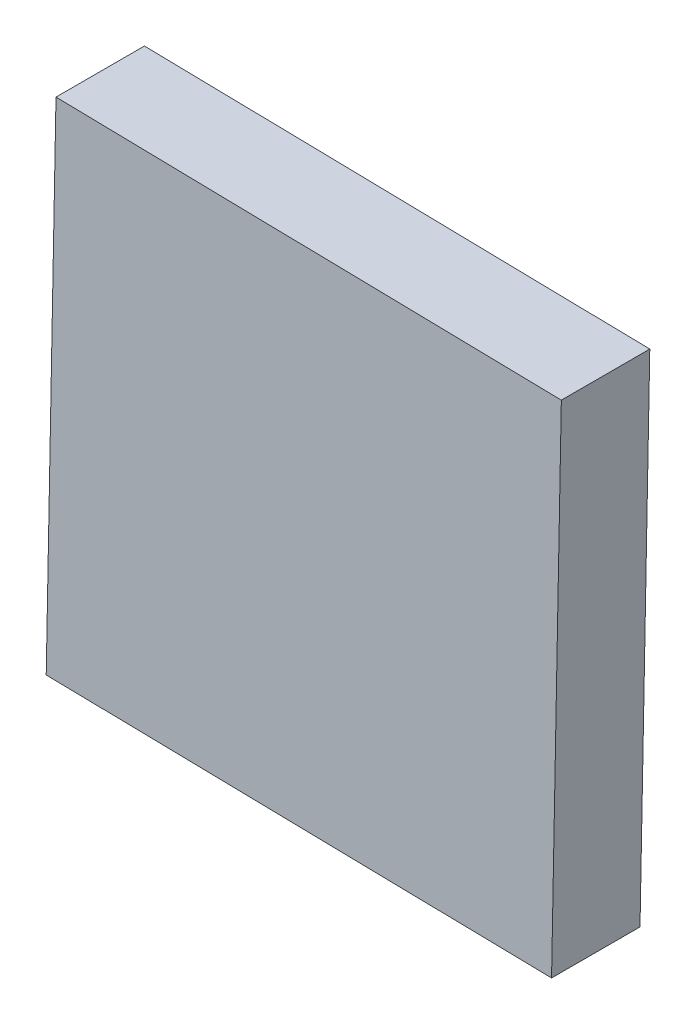
ISO-10303-21;
HEADER;
FILE_DESCRIPTION(('STEP AP214'),'2;1');
FILE_NAME('part.step','',(''),(''),'','','');
FILE_SCHEMA(('AUTOMOTIVE_DESIGN { 1 0 10303 214 1 1 1 1 }'));
ENDSEC;
DATA;
#1=APPLICATION_CONTEXT('core data for automotive mechanical design processes');
#2=APPLICATION_PROTOCOL_DEFINITION('international standard','automotive_design',2000,#1);
#3=PRODUCT_CONTEXT('',#1,'mechanical');
#4=PRODUCT('Part','Part','',(#3));
#5=PRODUCT_RELATED_PRODUCT_CATEGORY('part','',(#4));
#6=PRODUCT_DEFINITION_FORMATION('','',#4);
#7=PRODUCT_DEFINITION_CONTEXT('part definition',#1,'design');
#8=PRODUCT_DEFINITION('design','',#6,#7);
#9=PRODUCT_DEFINITION_SHAPE('','',#8);
#10=(LENGTH_UNIT() NAMED_UNIT(*) SI_UNIT(.MILLI.,.METRE.));
#11=(NAMED_UNIT(*) PLANE_ANGLE_UNIT() SI_UNIT($,.RADIAN.));
#12=(NAMED_UNIT(*) SI_UNIT($,.STERADIAN.) SOLID_ANGLE_UNIT());
#13=UNCERTAINTY_MEASURE_WITH_UNIT(LENGTH_MEASURE(1.E-05),#10,'distance_accuracy_value','');
#14=(GEOMETRIC_REPRESENTATION_CONTEXT(3) GLOBAL_UNCERTAINTY_ASSIGNED_CONTEXT((#13)) GLOBAL_UNIT_ASSIGNED_CONTEXT((#10,
#11,#12)) REPRESENTATION_CONTEXT('',''));
#15=CARTESIAN_POINT('',(0.,0.,0.));
#16=DIRECTION('',(0.,0.,1.));
#17=DIRECTION('',(1.,0.,0.));
#18=AXIS2_PLACEMENT_3D('',#15,#16,#17);
#19=CARTESIAN_POINT('',(-1.67734371468146,2.58988753102079,42.2620965279298));
#20=DIRECTION('',(0.,0.,1.));
#21=DIRECTION('',(0.999812677663925,-0.0193548335692301,0.));
#22=AXIS2_PLACEMENT_3D('',#19,#20,#21);
#23=PLANE('',#22);
#24=DIRECTION('',(0.0193548335692301,0.999812677663925,0.));
#25=VECTOR('',#24,1.);
#26=CARTESIAN_POINT('',(-4.26602919321367,0.0995246070202706,42.2620965279298));
#27=LINE('',#26,#25);
#28=CARTESIAN_POINT('',(-4.26602919321367,0.0995246070202706,42.2620965279298));
#29=VERTEX_POINT('',#28);
#30=CARTESIAN_POINT('',(-4.16770663868199,5.17857300955301,42.2620965279297));
#31=VERTEX_POINT('',#30);
#32=EDGE_CURVE('E58',#29,#31,#27,.T.);
#33=ORIENTED_EDGE('',*,*,#32,.T.);
#34=DIRECTION('',(0.999812677663925,-0.0193548335692299,0.));
#35=VECTOR('',#34,1.);
#36=CARTESIAN_POINT('',(-4.16770663868199,5.17857300955301,42.2620965279297));
#37=LINE('',#36,#35);
#38=CARTESIAN_POINT('',(0.911341763850753,5.08025045502132,42.2620965279299));
#39=VERTEX_POINT('',#38);
#40=EDGE_CURVE('E20',#31,#39,#37,.T.);
#41=ORIENTED_EDGE('',*,*,#40,.T.);
#42=DIRECTION('',(-0.0193548335692301,-0.999812677663925,0.));
#43=VECTOR('',#42,1.);
#44=CARTESIAN_POINT('',(0.813019209319064,0.00120205248858212,42.2620965279299));
#45=LINE('',#44,#43);
#46=CARTESIAN_POINT('',(0.813019209319064,0.00120205248858168,42.2620965279299));
#47=VERTEX_POINT('',#46);
#48=EDGE_CURVE('E88',#39,#47,#45,.T.);
#49=ORIENTED_EDGE('',*,*,#48,.T.);
#50=DIRECTION('',(-0.999812677663925,0.0193548335692299,0.));
#51=VECTOR('',#50,1.);
#52=CARTESIAN_POINT('',(-4.26602919321367,0.0995246070202706,42.2620965279298));
#53=LINE('',#52,#51);
#54=EDGE_CURVE('E56',#47,#29,#53,.T.);
#55=ORIENTED_EDGE('',*,*,#54,.T.);
#56=EDGE_LOOP('',(#33,#41,#49,#55));
#57=FACE_BOUND('',#56,.T.);
#58=ADVANCED_FACE('F17',(#57),#23,.F.);
#59=CARTESIAN_POINT('',(-4.16770663868202,5.17857300955302,43.1510965279297));
#60=DIRECTION('',(-0.0193548335692299,-0.999812677663925,0.));
#61=DIRECTION('',(0.999812677663925,-0.0193548335692299,0.));
#62=AXIS2_PLACEMENT_3D('',#59,#60,#61);
#63=PLANE('',#62);
#64=DIRECTION('',(0.,0.,1.));
#65=VECTOR('',#64,1.);
#66=CARTESIAN_POINT('',(0.911341763850724,5.08025045502133,43.1510965279299));
#67=LINE('',#66,#65);
#68=CARTESIAN_POINT('',(0.911341763850724,5.08025045502133,43.1510965279299));
#69=VERTEX_POINT('',#68);
#70=EDGE_CURVE('E70',#69,#39,#67,.F.);
#71=ORIENTED_EDGE('',*,*,#70,.T.);
#72=ORIENTED_EDGE('',*,*,#40,.F.);
#73=DIRECTION('',(0.,0.,1.));
#74=VECTOR('',#73,1.);
#75=CARTESIAN_POINT('',(-4.16770663868202,5.17857300955302,43.1510965279297));
#76=LINE('',#75,#74);
#77=CARTESIAN_POINT('',(-4.16770663868202,5.17857300955302,43.1510965279297));
#78=VERTEX_POINT('',#77);
#79=EDGE_CURVE('E65',#31,#78,#76,.T.);
#80=ORIENTED_EDGE('',*,*,#79,.T.);
#81=DIRECTION('',(0.999812677663925,-0.0193548335692301,0.));
#82=VECTOR('',#81,1.);
#83=CARTESIAN_POINT('',(-1.62818243741564,5.12941173228718,43.1510965279298));
#84=LINE('',#83,#82);
#85=EDGE_CURVE('E93',#69,#78,#84,.F.);
#86=ORIENTED_EDGE('',*,*,#85,.F.);
#87=EDGE_LOOP('',(#71,#72,#80,#86));
#88=FACE_BOUND('',#87,.T.);
#89=ADVANCED_FACE('F67',(#88),#63,.F.);
#90=CARTESIAN_POINT('',(-4.26602919321371,0.0995246070202831,43.1510965279298));
#91=DIRECTION('',(0.999812677663925,-0.0193548335692301,0.));
#92=DIRECTION('',(0.0193548335692301,0.999812677663925,0.));
#93=AXIS2_PLACEMENT_3D('',#90,#91,#92);
#94=PLANE('',#93);
#95=ORIENTED_EDGE('',*,*,#79,.F.);
#96=ORIENTED_EDGE('',*,*,#32,.F.);
#97=DIRECTION('',(0.,0.,1.));
#98=VECTOR('',#97,1.);
#99=CARTESIAN_POINT('',(-4.26602919321371,0.0995246070202831,43.1510965279298));
#100=LINE('',#99,#98);
#101=CARTESIAN_POINT('',(-4.26602919321371,0.0995246070202831,43.1510965279298));
#102=VERTEX_POINT('',#101);
#103=EDGE_CURVE('E82',#29,#102,#100,.T.);
#104=ORIENTED_EDGE('',*,*,#103,.T.);
#105=DIRECTION('',(0.0193548335692301,0.999812677663925,0.));
#106=VECTOR('',#105,1.);
#107=CARTESIAN_POINT('',(-4.21686791594786,2.63904880828665,43.1510965279297));
#108=LINE('',#107,#106);
#109=EDGE_CURVE('E75',#78,#102,#108,.F.);
#110=ORIENTED_EDGE('',*,*,#109,.F.);
#111=EDGE_LOOP('',(#95,#96,#104,#110));
#112=FACE_BOUND('',#111,.T.);
#113=ADVANCED_FACE('F73',(#112),#94,.F.);
#114=CARTESIAN_POINT('',(-4.26602919321371,0.0995246070202831,43.1510965279298));
#115=DIRECTION('',(0.0193548335692299,0.999812677663925,0.));
#116=DIRECTION('',(-0.999812677663925,0.0193548335692299,0.));
#117=AXIS2_PLACEMENT_3D('',#114,#115,#116);
#118=PLANE('',#117);
#119=ORIENTED_EDGE('',*,*,#103,.F.);
#120=ORIENTED_EDGE('',*,*,#54,.F.);
#121=DIRECTION('',(0.,0.,1.));
#122=VECTOR('',#121,1.);
#123=CARTESIAN_POINT('',(0.813019209319036,0.00120205248859426,43.15109652793));
#124=LINE('',#123,#122);
#125=CARTESIAN_POINT('',(0.813019209319036,0.00120205248859426,43.15109652793));
#126=VERTEX_POINT('',#125);
#127=EDGE_CURVE('E36',#47,#126,#124,.T.);
#128=ORIENTED_EDGE('',*,*,#127,.T.);
#129=DIRECTION('',(0.999812677663925,-0.0193548335692301,0.));
#130=VECTOR('',#129,1.);
#131=CARTESIAN_POINT('',(-1.72650499194733,0.0503633297544385,43.1510965279299));
#132=LINE('',#131,#130);
#133=EDGE_CURVE('E27',#102,#126,#132,.T.);
#134=ORIENTED_EDGE('',*,*,#133,.F.);
#135=EDGE_LOOP('',(#119,#120,#128,#134));
#136=FACE_BOUND('',#135,.T.);
#137=ADVANCED_FACE('F102',(#136),#118,.F.);
#138=CARTESIAN_POINT('',(0.813019209319036,0.00120205248859469,43.15109652793));
#139=DIRECTION('',(-0.999812677663925,0.0193548335692301,0.));
#140=DIRECTION('',(-0.0193548335692301,-0.999812677663925,0.));
#141=AXIS2_PLACEMENT_3D('',#138,#139,#140);
#142=PLANE('',#141);
#143=ORIENTED_EDGE('',*,*,#127,.F.);
#144=ORIENTED_EDGE('',*,*,#48,.F.);
#145=ORIENTED_EDGE('',*,*,#70,.F.);
#146=DIRECTION('',(0.0193548335692301,0.999812677663925,0.));
#147=VECTOR('',#146,1.);
#148=CARTESIAN_POINT('',(0.86218048658488,2.54072625375496,43.15109652793));
#149=LINE('',#148,#147);
#150=EDGE_CURVE('E11',#126,#69,#149,.T.);
#151=ORIENTED_EDGE('',*,*,#150,.F.);
#152=EDGE_LOOP('',(#143,#144,#145,#151));
#153=FACE_BOUND('',#152,.T.);
#154=ADVANCED_FACE('F104',(#153),#142,.F.);
#155=CARTESIAN_POINT('',(-1.67734371468149,2.58988753102081,43.1510965279299));
#156=DIRECTION('',(0.,0.,1.));
#157=DIRECTION('',(0.999812677663925,-0.0193548335692301,0.));
#158=AXIS2_PLACEMENT_3D('',#155,#156,#157);
#159=PLANE('',#158);
#160=ORIENTED_EDGE('',*,*,#133,.T.);
#161=ORIENTED_EDGE('',*,*,#150,.T.);
#162=ORIENTED_EDGE('',*,*,#85,.T.);
#163=ORIENTED_EDGE('',*,*,#109,.T.);
#164=EDGE_LOOP('',(#160,#161,#162,#163));
#165=FACE_BOUND('',#164,.T.);
#166=ADVANCED_FACE('F101',(#165),#159,.T.);
#167=CLOSED_SHELL('',(#58,#89,#113,#137,#154,#166));
#168=MANIFOLD_SOLID_BREP('B1',#167);
#169=ADVANCED_BREP_SHAPE_REPRESENTATION('',(#18,#168),#14);
#170=SHAPE_DEFINITION_REPRESENTATION(#9,#169);
ENDSEC;
END-ISO-10303-21;
